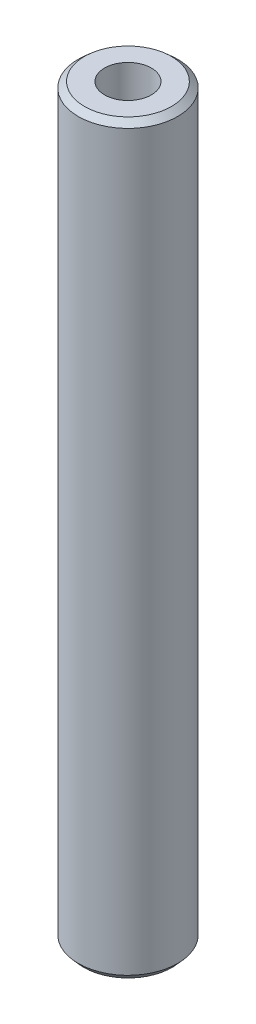
ISO-10303-21;
HEADER;
FILE_DESCRIPTION(('STEP AP214'),'2;1');
FILE_NAME('part.step','',(''),(''),'','','');
FILE_SCHEMA(('AUTOMOTIVE_DESIGN { 1 0 10303 214 1 1 1 1 }'));
ENDSEC;
DATA;
#1=APPLICATION_CONTEXT('core data for automotive mechanical design processes');
#2=APPLICATION_PROTOCOL_DEFINITION('international standard','automotive_design',2000,#1);
#3=PRODUCT_CONTEXT('',#1,'mechanical');
#4=PRODUCT('Part','Part','',(#3));
#5=PRODUCT_RELATED_PRODUCT_CATEGORY('part','',(#4));
#6=PRODUCT_DEFINITION_FORMATION('','',#4);
#7=PRODUCT_DEFINITION_CONTEXT('part definition',#1,'design');
#8=PRODUCT_DEFINITION('design','',#6,#7);
#9=PRODUCT_DEFINITION_SHAPE('','',#8);
#10=(LENGTH_UNIT() NAMED_UNIT(*) SI_UNIT(.MILLI.,.METRE.));
#11=(NAMED_UNIT(*) PLANE_ANGLE_UNIT() SI_UNIT($,.RADIAN.));
#12=(NAMED_UNIT(*) SI_UNIT($,.STERADIAN.) SOLID_ANGLE_UNIT());
#13=UNCERTAINTY_MEASURE_WITH_UNIT(LENGTH_MEASURE(1.E-05),#10,'distance_accuracy_value','');
#14=(GEOMETRIC_REPRESENTATION_CONTEXT(3) GLOBAL_UNCERTAINTY_ASSIGNED_CONTEXT((#13)) GLOBAL_UNIT_ASSIGNED_CONTEXT((#10,
#11,#12)) REPRESENTATION_CONTEXT('',''));
#15=CARTESIAN_POINT('',(0.,0.,0.));
#16=DIRECTION('',(0.,0.,1.));
#17=DIRECTION('',(1.,0.,0.));
#18=AXIS2_PLACEMENT_3D('',#15,#16,#17);
#19=CARTESIAN_POINT('',(0.,600.,0.));
#20=DIRECTION('',(0.,-1.,0.));
#21=DIRECTION('',(0.,0.,-1.));
#22=AXIS2_PLACEMENT_3D('',#19,#20,#21);
#23=CYLINDRICAL_SURFACE('',#22,40.);
#24=CARTESIAN_POINT('',(0.,595.540946554691,0.));
#25=DIRECTION('',(0.,1.,0.));
#26=DIRECTION('',(0.,0.,1.));
#27=AXIS2_PLACEMENT_3D('',#24,#25,#26);
#28=CIRCLE('',#27,40.);
#29=CARTESIAN_POINT('',(0.,595.540946554691,40.));
#30=VERTEX_POINT('',#29);
#31=EDGE_CURVE('E50',#30,#30,#28,.F.);
#32=ORIENTED_EDGE('',*,*,#31,.T.);
#33=EDGE_LOOP('',(#32));
#34=FACE_BOUND('',#33,.T.);
#35=CARTESIAN_POINT('',(0.,5.03259081999941,0.));
#36=DIRECTION('',(0.,1.,0.));
#37=DIRECTION('',(0.,0.,1.));
#38=AXIS2_PLACEMENT_3D('',#35,#36,#37);
#39=CIRCLE('',#38,40.);
#40=CARTESIAN_POINT('',(0.,5.03259081999941,40.));
#41=VERTEX_POINT('',#40);
#42=EDGE_CURVE('E51',#41,#41,#39,.T.);
#43=ORIENTED_EDGE('',*,*,#42,.T.);
#44=EDGE_LOOP('',(#43));
#45=FACE_BOUND('',#44,.T.);
#46=ADVANCED_FACE('F39',(#34,#45),#23,.T.);
#47=CARTESIAN_POINT('',(0.,600.,0.));
#48=DIRECTION('',(0.,1.,0.));
#49=DIRECTION('',(0.,0.,1.));
#50=AXIS2_PLACEMENT_3D('',#47,#48,#49);
#51=PLANE('',#50);
#52=CARTESIAN_POINT('',(0.,600.,0.));
#53=DIRECTION('',(0.,1.,0.));
#54=DIRECTION('',(0.,0.,1.));
#55=AXIS2_PLACEMENT_3D('',#52,#53,#54);
#56=CIRCLE('',#55,34.9674091800005);
#57=CARTESIAN_POINT('',(0.,600.,34.9674091800005));
#58=VERTEX_POINT('',#57);
#59=EDGE_CURVE('E54',#58,#58,#56,.T.);
#60=ORIENTED_EDGE('',*,*,#59,.T.);
#61=EDGE_LOOP('',(#60));
#62=FACE_BOUND('',#61,.T.);
#63=CARTESIAN_POINT('',(0.,600.,0.));
#64=DIRECTION('',(0.,1.,0.));
#65=DIRECTION('',(0.,0.,1.));
#66=AXIS2_PLACEMENT_3D('',#63,#64,#65);
#67=CIRCLE('',#66,18.8080726772632);
#68=CARTESIAN_POINT('',(0.,600.,18.8080726772632));
#69=VERTEX_POINT('',#68);
#70=EDGE_CURVE('E58',#69,#69,#67,.T.);
#71=ORIENTED_EDGE('',*,*,#70,.F.);
#72=EDGE_LOOP('',(#71));
#73=FACE_BOUND('',#72,.T.);
#74=ADVANCED_FACE('F69',(#62,#73),#51,.T.);
#75=CARTESIAN_POINT('',(0.,0.,0.));
#76=DIRECTION('',(0.,1.,0.));
#77=DIRECTION('',(0.,0.,1.));
#78=AXIS2_PLACEMENT_3D('',#75,#76,#77);
#79=PLANE('',#78);
#80=CARTESIAN_POINT('',(0.,0.,0.));
#81=DIRECTION('',(0.,1.,0.));
#82=DIRECTION('',(0.,0.,1.));
#83=AXIS2_PLACEMENT_3D('',#80,#81,#82);
#84=CIRCLE('',#83,35.5409465546915);
#85=CARTESIAN_POINT('',(0.,0.,35.5409465546915));
#86=VERTEX_POINT('',#85);
#87=EDGE_CURVE('E10',#86,#86,#84,.F.);
#88=ORIENTED_EDGE('',*,*,#87,.T.);
#89=EDGE_LOOP('',(#88));
#90=FACE_BOUND('',#89,.T.);
#91=CARTESIAN_POINT('',(0.,0.,0.));
#92=DIRECTION('',(0.,1.,0.));
#93=DIRECTION('',(0.,0.,1.));
#94=AXIS2_PLACEMENT_3D('',#91,#92,#93);
#95=CIRCLE('',#94,18.8080726772632);
#96=CARTESIAN_POINT('',(0.,0.,18.8080726772632));
#97=VERTEX_POINT('',#96);
#98=EDGE_CURVE('E63',#97,#97,#95,.T.);
#99=ORIENTED_EDGE('',*,*,#98,.T.);
#100=EDGE_LOOP('',(#99));
#101=FACE_BOUND('',#100,.T.);
#102=ADVANCED_FACE('F75',(#90,#101),#79,.F.);
#103=CARTESIAN_POINT('',(0.,600.,0.));
#104=DIRECTION('',(0.,-1.,0.));
#105=DIRECTION('',(0.,0.,-1.));
#106=AXIS2_PLACEMENT_3D('',#103,#104,#105);
#107=CYLINDRICAL_SURFACE('',#106,18.8080726772632);
#108=ORIENTED_EDGE('',*,*,#70,.T.);
#109=EDGE_LOOP('',(#108));
#110=FACE_BOUND('',#109,.T.);
#111=ORIENTED_EDGE('',*,*,#98,.F.);
#112=EDGE_LOOP('',(#111));
#113=FACE_BOUND('',#112,.T.);
#114=ADVANCED_FACE('F70',(#110,#113),#107,.F.);
#115=CARTESIAN_POINT('',(0.,600.,0.));
#116=DIRECTION('',(0.,-1.,0.));
#117=DIRECTION('',(0.,0.,-1.));
#118=AXIS2_PLACEMENT_3D('',#115,#116,#117);
#119=CONICAL_SURFACE('',#118,34.9674091800005,0.845750283936773);
#120=ORIENTED_EDGE('',*,*,#31,.F.);
#121=EDGE_LOOP('',(#120));
#122=FACE_BOUND('',#121,.T.);
#123=ORIENTED_EDGE('',*,*,#59,.F.);
#124=EDGE_LOOP('',(#123));
#125=FACE_BOUND('',#124,.T.);
#126=ADVANCED_FACE('F81',(#122,#125),#119,.T.);
#127=CARTESIAN_POINT('',(0.,5.03259081999941,0.));
#128=DIRECTION('',(0.,1.,0.));
#129=DIRECTION('',(0.,0.,1.));
#130=AXIS2_PLACEMENT_3D('',#127,#128,#129);
#131=CONICAL_SURFACE('',#130,40.,0.725046042858114);
#132=ORIENTED_EDGE('',*,*,#87,.F.);
#133=EDGE_LOOP('',(#132));
#134=FACE_BOUND('',#133,.T.);
#135=ORIENTED_EDGE('',*,*,#42,.F.);
#136=EDGE_LOOP('',(#135));
#137=FACE_BOUND('',#136,.T.);
#138=ADVANCED_FACE('F45',(#134,#137),#131,.T.);
#139=CLOSED_SHELL('',(#46,#74,#102,#114,#126,#138));
#140=MANIFOLD_SOLID_BREP('B2',#139);
#141=ADVANCED_BREP_SHAPE_REPRESENTATION('',(#18,#140),#14);
#142=SHAPE_DEFINITION_REPRESENTATION(#9,#141);
ENDSEC;
END-ISO-10303-21;
